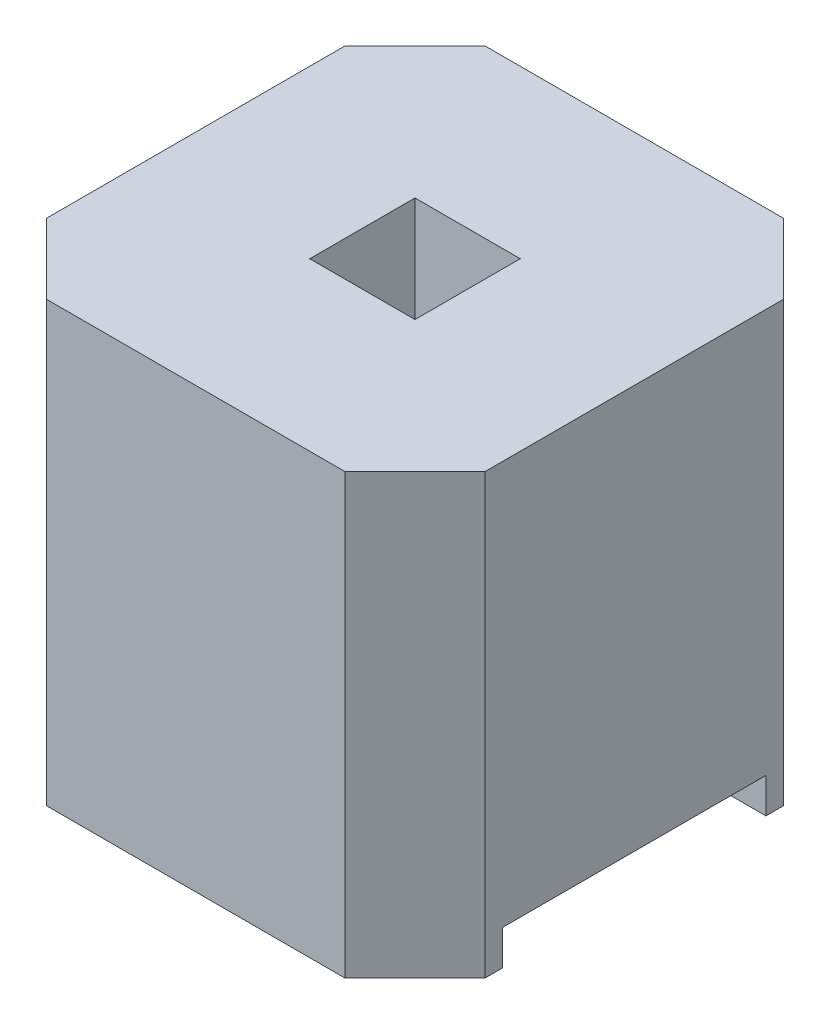
ISO-10303-21;
HEADER;
FILE_DESCRIPTION(('STEP AP214'),'2;1');
FILE_NAME('part.step','',(''),(''),'','','');
FILE_SCHEMA(('AUTOMOTIVE_DESIGN { 1 0 10303 214 1 1 1 1 }'));
ENDSEC;
DATA;
#1=APPLICATION_CONTEXT('core data for automotive mechanical design processes');
#2=APPLICATION_PROTOCOL_DEFINITION('international standard','automotive_design',2000,#1);
#3=PRODUCT_CONTEXT('',#1,'mechanical');
#4=PRODUCT('Part','Part','',(#3));
#5=PRODUCT_RELATED_PRODUCT_CATEGORY('part','',(#4));
#6=PRODUCT_DEFINITION_FORMATION('','',#4);
#7=PRODUCT_DEFINITION_CONTEXT('part definition',#1,'design');
#8=PRODUCT_DEFINITION('design','',#6,#7);
#9=PRODUCT_DEFINITION_SHAPE('','',#8);
#10=(LENGTH_UNIT() NAMED_UNIT(*) SI_UNIT(.MILLI.,.METRE.));
#11=(NAMED_UNIT(*) PLANE_ANGLE_UNIT() SI_UNIT($,.RADIAN.));
#12=(NAMED_UNIT(*) SI_UNIT($,.STERADIAN.) SOLID_ANGLE_UNIT());
#13=UNCERTAINTY_MEASURE_WITH_UNIT(LENGTH_MEASURE(1.E-05),#10,'distance_accuracy_value','');
#14=(GEOMETRIC_REPRESENTATION_CONTEXT(3) GLOBAL_UNCERTAINTY_ASSIGNED_CONTEXT((#13)) GLOBAL_UNIT_ASSIGNED_CONTEXT((#10,
#11,#12)) REPRESENTATION_CONTEXT('',''));
#15=CARTESIAN_POINT('',(0.,0.,0.));
#16=DIRECTION('',(0.,0.,1.));
#17=DIRECTION('',(1.,0.,0.));
#18=AXIS2_PLACEMENT_3D('',#15,#16,#17);
#19=CARTESIAN_POINT('',(0.,0.,0.));
#20=DIRECTION('',(0.,-1.,0.));
#21=DIRECTION('',(0.,0.,-1.));
#22=AXIS2_PLACEMENT_3D('',#19,#20,#21);
#23=PLANE('',#22);
#24=DIRECTION('',(-1.,0.,0.));
#25=VECTOR('',#24,1.);
#26=CARTESIAN_POINT('',(0.,0.,0.75));
#27=LINE('',#26,#25);
#28=CARTESIAN_POINT('',(1.25,0.,0.75));
#29=VERTEX_POINT('',#28);
#30=CARTESIAN_POINT('',(-1.25,0.,0.75));
#31=VERTEX_POINT('',#30);
#32=EDGE_CURVE('E283',#29,#31,#27,.T.);
#33=ORIENTED_EDGE('',*,*,#32,.F.);
#34=DIRECTION('',(0.,0.,-1.));
#35=VECTOR('',#34,1.);
#36=CARTESIAN_POINT('',(1.25,0.,0.850000000000001));
#37=LINE('',#36,#35);
#38=CARTESIAN_POINT('',(1.25,0.,0.850000000000001));
#39=VERTEX_POINT('',#38);
#40=EDGE_CURVE('E165',#39,#29,#37,.T.);
#41=ORIENTED_EDGE('',*,*,#40,.F.);
#42=DIRECTION('',(0.707106781186547,0.,-0.707106781186548));
#43=VECTOR('',#42,1.);
#44=CARTESIAN_POINT('',(0.850000000000001,0.,1.25));
#45=LINE('',#44,#43);
#46=CARTESIAN_POINT('',(0.850000000000001,0.,1.25));
#47=VERTEX_POINT('',#46);
#48=EDGE_CURVE('E176',#47,#39,#45,.T.);
#49=ORIENTED_EDGE('',*,*,#48,.F.);
#50=DIRECTION('',(1.,0.,0.));
#51=VECTOR('',#50,1.);
#52=CARTESIAN_POINT('',(-0.85,0.,1.25));
#53=LINE('',#52,#51);
#54=CARTESIAN_POINT('',(-0.85,0.,1.25));
#55=VERTEX_POINT('',#54);
#56=EDGE_CURVE('E257',#55,#47,#53,.T.);
#57=ORIENTED_EDGE('',*,*,#56,.F.);
#58=DIRECTION('',(0.707106781186547,0.,0.707106781186547));
#59=VECTOR('',#58,1.);
#60=CARTESIAN_POINT('',(-1.25,0.,0.850000000000001));
#61=LINE('',#60,#59);
#62=CARTESIAN_POINT('',(-1.25,0.,0.850000000000001));
#63=VERTEX_POINT('',#62);
#64=EDGE_CURVE('E256',#63,#55,#61,.T.);
#65=ORIENTED_EDGE('',*,*,#64,.F.);
#66=DIRECTION('',(0.,0.,1.));
#67=VECTOR('',#66,1.);
#68=CARTESIAN_POINT('',(-1.25,0.,0.850000000000001));
#69=LINE('',#68,#67);
#70=EDGE_CURVE('E237',#31,#63,#69,.T.);
#71=ORIENTED_EDGE('',*,*,#70,.F.);
#72=EDGE_LOOP('',(#33,#41,#49,#57,#65,#71));
#73=FACE_BOUND('',#72,.T.);
#74=ADVANCED_FACE('F32',(#73),#23,.T.);
#75=CARTESIAN_POINT('',(0.,2.5,0.));
#76=DIRECTION('',(0.,-1.,0.));
#77=DIRECTION('',(0.,0.,-1.));
#78=AXIS2_PLACEMENT_3D('',#75,#76,#77);
#79=PLANE('',#78);
#80=DIRECTION('',(0.,0.,1.));
#81=VECTOR('',#80,1.);
#82=CARTESIAN_POINT('',(-1.25,2.5,0.850000000000001));
#83=LINE('',#82,#81);
#84=CARTESIAN_POINT('',(-1.25,2.5,-0.849999999999999));
#85=VERTEX_POINT('',#84);
#86=CARTESIAN_POINT('',(-1.25,2.5,0.850000000000001));
#87=VERTEX_POINT('',#86);
#88=EDGE_CURVE('E183',#85,#87,#83,.T.);
#89=ORIENTED_EDGE('',*,*,#88,.T.);
#90=DIRECTION('',(0.707106781186547,0.,0.707106781186547));
#91=VECTOR('',#90,1.);
#92=CARTESIAN_POINT('',(-1.25,2.5,0.850000000000001));
#93=LINE('',#92,#91);
#94=CARTESIAN_POINT('',(-0.85,2.5,1.25));
#95=VERTEX_POINT('',#94);
#96=EDGE_CURVE('E240',#87,#95,#93,.T.);
#97=ORIENTED_EDGE('',*,*,#96,.T.);
#98=DIRECTION('',(1.,0.,0.));
#99=VECTOR('',#98,1.);
#100=CARTESIAN_POINT('',(-0.85,2.5,1.25));
#101=LINE('',#100,#99);
#102=CARTESIAN_POINT('',(0.850000000000001,2.5,1.25));
#103=VERTEX_POINT('',#102);
#104=EDGE_CURVE('E242',#95,#103,#101,.T.);
#105=ORIENTED_EDGE('',*,*,#104,.T.);
#106=DIRECTION('',(0.707106781186547,0.,-0.707106781186548));
#107=VECTOR('',#106,1.);
#108=CARTESIAN_POINT('',(0.850000000000001,2.5,1.25));
#109=LINE('',#108,#107);
#110=CARTESIAN_POINT('',(1.25,2.5,0.850000000000001));
#111=VERTEX_POINT('',#110);
#112=EDGE_CURVE('E244',#103,#111,#109,.T.);
#113=ORIENTED_EDGE('',*,*,#112,.T.);
#114=DIRECTION('',(0.,0.,-1.));
#115=VECTOR('',#114,1.);
#116=CARTESIAN_POINT('',(1.25,2.5,0.850000000000001));
#117=LINE('',#116,#115);
#118=CARTESIAN_POINT('',(1.25,2.5,-0.849999999999999));
#119=VERTEX_POINT('',#118);
#120=EDGE_CURVE('E246',#111,#119,#117,.T.);
#121=ORIENTED_EDGE('',*,*,#120,.T.);
#122=DIRECTION('',(-0.707106781186547,0.,-0.707106781186547));
#123=VECTOR('',#122,1.);
#124=CARTESIAN_POINT('',(0.85,2.5,-1.25));
#125=LINE('',#124,#123);
#126=CARTESIAN_POINT('',(0.85,2.5,-1.25));
#127=VERTEX_POINT('',#126);
#128=EDGE_CURVE('E248',#119,#127,#125,.T.);
#129=ORIENTED_EDGE('',*,*,#128,.T.);
#130=DIRECTION('',(-1.,0.,0.));
#131=VECTOR('',#130,1.);
#132=CARTESIAN_POINT('',(-0.85,2.5,-1.25));
#133=LINE('',#132,#131);
#134=CARTESIAN_POINT('',(-0.85,2.5,-1.25));
#135=VERTEX_POINT('',#134);
#136=EDGE_CURVE('E250',#127,#135,#133,.T.);
#137=ORIENTED_EDGE('',*,*,#136,.T.);
#138=DIRECTION('',(-0.707106781186547,0.,0.707106781186547));
#139=VECTOR('',#138,1.);
#140=CARTESIAN_POINT('',(-1.25,2.5,-0.849999999999999));
#141=LINE('',#140,#139);
#142=EDGE_CURVE('E188',#135,#85,#141,.T.);
#143=ORIENTED_EDGE('',*,*,#142,.T.);
#144=EDGE_LOOP('',(#89,#97,#105,#113,#121,#129,#137,#143));
#145=FACE_BOUND('',#144,.T.);
#146=DIRECTION('',(0.,0.,1.));
#147=VECTOR('',#146,1.);
#148=CARTESIAN_POINT('',(-0.3,2.5,-0.299999999999999));
#149=LINE('',#148,#147);
#150=CARTESIAN_POINT('',(-0.3,2.5,-0.299999999999999));
#151=VERTEX_POINT('',#150);
#152=CARTESIAN_POINT('',(-0.3,2.5,0.3));
#153=VERTEX_POINT('',#152);
#154=EDGE_CURVE('E285',#151,#153,#149,.T.);
#155=ORIENTED_EDGE('',*,*,#154,.F.);
#156=DIRECTION('',(-1.,0.,0.));
#157=VECTOR('',#156,1.);
#158=CARTESIAN_POINT('',(0.3,2.5,-0.3));
#159=LINE('',#158,#157);
#160=CARTESIAN_POINT('',(0.3,2.5,-0.3));
#161=VERTEX_POINT('',#160);
#162=EDGE_CURVE('E225',#161,#151,#159,.T.);
#163=ORIENTED_EDGE('',*,*,#162,.F.);
#164=DIRECTION('',(0.,0.,-1.));
#165=VECTOR('',#164,1.);
#166=CARTESIAN_POINT('',(0.3,2.5,-0.3));
#167=LINE('',#166,#165);
#168=CARTESIAN_POINT('',(0.3,2.5,0.3));
#169=VERTEX_POINT('',#168);
#170=EDGE_CURVE('E230',#169,#161,#167,.T.);
#171=ORIENTED_EDGE('',*,*,#170,.F.);
#172=DIRECTION('',(1.,0.,0.));
#173=VECTOR('',#172,1.);
#174=CARTESIAN_POINT('',(0.3,2.5,0.3));
#175=LINE('',#174,#173);
#176=EDGE_CURVE('E287',#153,#169,#175,.T.);
#177=ORIENTED_EDGE('',*,*,#176,.F.);
#178=EDGE_LOOP('',(#155,#163,#171,#177));
#179=FACE_BOUND('',#178,.T.);
#180=ADVANCED_FACE('F295',(#145,#179),#79,.F.);
#181=DIRECTION('',(1.,0.,0.));
#182=VECTOR('',#181,1.);
#183=CARTESIAN_POINT('',(0.,0.,-0.75));
#184=LINE('',#183,#182);
#185=CARTESIAN_POINT('',(-1.25,0.,-0.75));
#186=VERTEX_POINT('',#185);
#187=CARTESIAN_POINT('',(1.25,0.,-0.75));
#188=VERTEX_POINT('',#187);
#189=EDGE_CURVE('E220',#186,#188,#184,.T.);
#190=ORIENTED_EDGE('',*,*,#189,.F.);
#191=CARTESIAN_POINT('',(-1.25,0.,-0.849999999999999));
#192=VERTEX_POINT('',#191);
#193=EDGE_CURVE('E253',#192,#186,#69,.T.);
#194=ORIENTED_EDGE('',*,*,#193,.F.);
#195=DIRECTION('',(-0.707106781186547,0.,0.707106781186547));
#196=VECTOR('',#195,1.);
#197=CARTESIAN_POINT('',(-1.25,0.,-0.849999999999999));
#198=LINE('',#197,#196);
#199=CARTESIAN_POINT('',(-0.85,0.,-1.25));
#200=VERTEX_POINT('',#199);
#201=EDGE_CURVE('E181',#200,#192,#198,.T.);
#202=ORIENTED_EDGE('',*,*,#201,.F.);
#203=DIRECTION('',(-1.,0.,0.));
#204=VECTOR('',#203,1.);
#205=CARTESIAN_POINT('',(-0.85,0.,-1.25));
#206=LINE('',#205,#204);
#207=CARTESIAN_POINT('',(0.85,0.,-1.25));
#208=VERTEX_POINT('',#207);
#209=EDGE_CURVE('E174',#208,#200,#206,.T.);
#210=ORIENTED_EDGE('',*,*,#209,.F.);
#211=DIRECTION('',(-0.707106781186547,0.,-0.707106781186547));
#212=VECTOR('',#211,1.);
#213=CARTESIAN_POINT('',(0.85,0.,-1.25));
#214=LINE('',#213,#212);
#215=CARTESIAN_POINT('',(1.25,0.,-0.849999999999999));
#216=VERTEX_POINT('',#215);
#217=EDGE_CURVE('E171',#216,#208,#214,.T.);
#218=ORIENTED_EDGE('',*,*,#217,.F.);
#219=EDGE_CURVE('E172',#188,#216,#37,.T.);
#220=ORIENTED_EDGE('',*,*,#219,.F.);
#221=EDGE_LOOP('',(#190,#194,#202,#210,#218,#220));
#222=FACE_BOUND('',#221,.T.);
#223=ADVANCED_FACE('F309',(#222),#23,.T.);
#224=CARTESIAN_POINT('',(-1.25,2.5,0.850000000000001));
#225=DIRECTION('',(1.,0.,0.));
#226=DIRECTION('',(0.,0.,-1.));
#227=AXIS2_PLACEMENT_3D('',#224,#225,#226);
#228=PLANE('',#227);
#229=DIRECTION('',(0.,0.,-1.));
#230=VECTOR('',#229,1.);
#231=CARTESIAN_POINT('',(-1.25,0.2,-0.75));
#232=LINE('',#231,#230);
#233=CARTESIAN_POINT('',(-1.25,0.2,0.75));
#234=VERTEX_POINT('',#233);
#235=CARTESIAN_POINT('',(-1.25,0.2,-0.75));
#236=VERTEX_POINT('',#235);
#237=EDGE_CURVE('E273',#234,#236,#232,.T.);
#238=ORIENTED_EDGE('',*,*,#237,.F.);
#239=DIRECTION('',(0.,1.,0.));
#240=VECTOR('',#239,1.);
#241=CARTESIAN_POINT('',(-1.25,-0.2,0.75));
#242=LINE('',#241,#240);
#243=EDGE_CURVE('E149',#31,#234,#242,.T.);
#244=ORIENTED_EDGE('',*,*,#243,.F.);
#245=ORIENTED_EDGE('',*,*,#70,.T.);
#246=DIRECTION('',(0.,-1.,0.));
#247=VECTOR('',#246,1.);
#248=CARTESIAN_POINT('',(-1.25,2.5,0.850000000000001));
#249=LINE('',#248,#247);
#250=EDGE_CURVE('E204',#87,#63,#249,.T.);
#251=ORIENTED_EDGE('',*,*,#250,.F.);
#252=ORIENTED_EDGE('',*,*,#88,.F.);
#253=DIRECTION('',(0.,-1.,0.));
#254=VECTOR('',#253,1.);
#255=CARTESIAN_POINT('',(-1.25,2.5,-0.849999999999999));
#256=LINE('',#255,#254);
#257=EDGE_CURVE('E184',#85,#192,#256,.T.);
#258=ORIENTED_EDGE('',*,*,#257,.T.);
#259=ORIENTED_EDGE('',*,*,#193,.T.);
#260=DIRECTION('',(0.,-1.,0.));
#261=VECTOR('',#260,1.);
#262=CARTESIAN_POINT('',(-1.25,-0.2,-0.75));
#263=LINE('',#262,#261);
#264=EDGE_CURVE('E159',#236,#186,#263,.T.);
#265=ORIENTED_EDGE('',*,*,#264,.F.);
#266=EDGE_LOOP('',(#238,#244,#245,#251,#252,#258,#259,#265));
#267=FACE_BOUND('',#266,.T.);
#268=ADVANCED_FACE('F34',(#267),#228,.F.);
#269=CARTESIAN_POINT('',(-1.25,2.5,0.850000000000001));
#270=DIRECTION('',(0.707106781186548,0.,-0.707106781186548));
#271=DIRECTION('',(-0.707106781186548,0.,-0.707106781186548));
#272=AXIS2_PLACEMENT_3D('',#269,#270,#271);
#273=PLANE('',#272);
#274=ORIENTED_EDGE('',*,*,#64,.T.);
#275=DIRECTION('',(0.,-1.,0.));
#276=VECTOR('',#275,1.);
#277=CARTESIAN_POINT('',(-0.85,2.5,1.25));
#278=LINE('',#277,#276);
#279=EDGE_CURVE('E201',#95,#55,#278,.T.);
#280=ORIENTED_EDGE('',*,*,#279,.F.);
#281=ORIENTED_EDGE('',*,*,#96,.F.);
#282=ORIENTED_EDGE('',*,*,#250,.T.);
#283=EDGE_LOOP('',(#274,#280,#281,#282));
#284=FACE_BOUND('',#283,.T.);
#285=ADVANCED_FACE('F269',(#284),#273,.F.);
#286=CARTESIAN_POINT('',(-0.85,2.5,1.25));
#287=DIRECTION('',(0.,0.,-1.));
#288=DIRECTION('',(-1.,0.,0.));
#289=AXIS2_PLACEMENT_3D('',#286,#287,#288);
#290=PLANE('',#289);
#291=ORIENTED_EDGE('',*,*,#56,.T.);
#292=DIRECTION('',(0.,-1.,0.));
#293=VECTOR('',#292,1.);
#294=CARTESIAN_POINT('',(0.850000000000001,2.5,1.25));
#295=LINE('',#294,#293);
#296=EDGE_CURVE('E198',#103,#47,#295,.T.);
#297=ORIENTED_EDGE('',*,*,#296,.F.);
#298=ORIENTED_EDGE('',*,*,#104,.F.);
#299=ORIENTED_EDGE('',*,*,#279,.T.);
#300=EDGE_LOOP('',(#291,#297,#298,#299));
#301=FACE_BOUND('',#300,.T.);
#302=ADVANCED_FACE('F340',(#301),#290,.F.);
#303=CARTESIAN_POINT('',(0.850000000000001,2.5,1.25));
#304=DIRECTION('',(-0.707106781186548,0.,-0.707106781186547));
#305=DIRECTION('',(-0.707106781186547,0.,0.707106781186548));
#306=AXIS2_PLACEMENT_3D('',#303,#304,#305);
#307=PLANE('',#306);
#308=ORIENTED_EDGE('',*,*,#48,.T.);
#309=DIRECTION('',(0.,-1.,0.));
#310=VECTOR('',#309,1.);
#311=CARTESIAN_POINT('',(1.25,2.5,0.850000000000001));
#312=LINE('',#311,#310);
#313=EDGE_CURVE('E168',#111,#39,#312,.T.);
#314=ORIENTED_EDGE('',*,*,#313,.F.);
#315=ORIENTED_EDGE('',*,*,#112,.F.);
#316=ORIENTED_EDGE('',*,*,#296,.T.);
#317=EDGE_LOOP('',(#308,#314,#315,#316));
#318=FACE_BOUND('',#317,.T.);
#319=ADVANCED_FACE('F262',(#318),#307,.F.);
#320=CARTESIAN_POINT('',(1.25,2.5,0.850000000000001));
#321=DIRECTION('',(-1.,0.,0.));
#322=DIRECTION('',(0.,0.,1.));
#323=AXIS2_PLACEMENT_3D('',#320,#321,#322);
#324=PLANE('',#323);
#325=ORIENTED_EDGE('',*,*,#40,.T.);
#326=DIRECTION('',(0.,1.,0.));
#327=VECTOR('',#326,1.);
#328=CARTESIAN_POINT('',(1.25,2.5,0.75));
#329=LINE('',#328,#327);
#330=CARTESIAN_POINT('',(1.25,0.2,0.75));
#331=VERTEX_POINT('',#330);
#332=EDGE_CURVE('E11',#29,#331,#329,.T.);
#333=ORIENTED_EDGE('',*,*,#332,.T.);
#334=DIRECTION('',(0.,0.,-1.));
#335=VECTOR('',#334,1.);
#336=CARTESIAN_POINT('',(1.25,0.2,-0.75));
#337=LINE('',#336,#335);
#338=CARTESIAN_POINT('',(1.25,0.2,-0.75));
#339=VERTEX_POINT('',#338);
#340=EDGE_CURVE('E156',#331,#339,#337,.T.);
#341=ORIENTED_EDGE('',*,*,#340,.T.);
#342=DIRECTION('',(0.,-1.,0.));
#343=VECTOR('',#342,1.);
#344=CARTESIAN_POINT('',(1.25,-0.2,-0.75));
#345=LINE('',#344,#343);
#346=EDGE_CURVE('E47',#339,#188,#345,.T.);
#347=ORIENTED_EDGE('',*,*,#346,.T.);
#348=ORIENTED_EDGE('',*,*,#219,.T.);
#349=DIRECTION('',(0.,-1.,0.));
#350=VECTOR('',#349,1.);
#351=CARTESIAN_POINT('',(1.25,2.5,-0.849999999999999));
#352=LINE('',#351,#350);
#353=EDGE_CURVE('E194',#119,#216,#352,.T.);
#354=ORIENTED_EDGE('',*,*,#353,.F.);
#355=ORIENTED_EDGE('',*,*,#120,.F.);
#356=ORIENTED_EDGE('',*,*,#313,.T.);
#357=EDGE_LOOP('',(#325,#333,#341,#347,#348,#354,#355,#356));
#358=FACE_BOUND('',#357,.T.);
#359=ADVANCED_FACE('F162',(#358),#324,.F.);
#360=CARTESIAN_POINT('',(0.85,2.5,-1.25));
#361=DIRECTION('',(-0.707106781186548,0.,0.707106781186548));
#362=DIRECTION('',(0.707106781186548,0.,0.707106781186548));
#363=AXIS2_PLACEMENT_3D('',#360,#361,#362);
#364=PLANE('',#363);
#365=ORIENTED_EDGE('',*,*,#217,.T.);
#366=DIRECTION('',(0.,-1.,0.));
#367=VECTOR('',#366,1.);
#368=CARTESIAN_POINT('',(0.85,2.5,-1.25));
#369=LINE('',#368,#367);
#370=EDGE_CURVE('E191',#127,#208,#369,.T.);
#371=ORIENTED_EDGE('',*,*,#370,.F.);
#372=ORIENTED_EDGE('',*,*,#128,.F.);
#373=ORIENTED_EDGE('',*,*,#353,.T.);
#374=EDGE_LOOP('',(#365,#371,#372,#373));
#375=FACE_BOUND('',#374,.T.);
#376=ADVANCED_FACE('F337',(#375),#364,.F.);
#377=CARTESIAN_POINT('',(-0.85,2.5,-1.25));
#378=DIRECTION('',(0.,0.,1.));
#379=DIRECTION('',(1.,0.,0.));
#380=AXIS2_PLACEMENT_3D('',#377,#378,#379);
#381=PLANE('',#380);
#382=ORIENTED_EDGE('',*,*,#209,.T.);
#383=DIRECTION('',(0.,-1.,0.));
#384=VECTOR('',#383,1.);
#385=CARTESIAN_POINT('',(-0.85,2.5,-1.25));
#386=LINE('',#385,#384);
#387=EDGE_CURVE('E187',#135,#200,#386,.T.);
#388=ORIENTED_EDGE('',*,*,#387,.F.);
#389=ORIENTED_EDGE('',*,*,#136,.F.);
#390=ORIENTED_EDGE('',*,*,#370,.T.);
#391=EDGE_LOOP('',(#382,#388,#389,#390));
#392=FACE_BOUND('',#391,.T.);
#393=ADVANCED_FACE('F332',(#392),#381,.F.);
#394=CARTESIAN_POINT('',(-1.25,2.5,-0.849999999999999));
#395=DIRECTION('',(0.707106781186548,0.,0.707106781186548));
#396=DIRECTION('',(0.707106781186548,0.,-0.707106781186548));
#397=AXIS2_PLACEMENT_3D('',#394,#395,#396);
#398=PLANE('',#397);
#399=ORIENTED_EDGE('',*,*,#201,.T.);
#400=ORIENTED_EDGE('',*,*,#257,.F.);
#401=ORIENTED_EDGE('',*,*,#142,.F.);
#402=ORIENTED_EDGE('',*,*,#387,.T.);
#403=EDGE_LOOP('',(#399,#400,#401,#402));
#404=FACE_BOUND('',#403,.T.);
#405=ADVANCED_FACE('F305',(#404),#398,.F.);
#406=CARTESIAN_POINT('',(-0.3,2.5,-0.299999999999999));
#407=DIRECTION('',(1.,0.,0.));
#408=DIRECTION('',(0.,0.,-1.));
#409=AXIS2_PLACEMENT_3D('',#406,#407,#408);
#410=PLANE('',#409);
#411=DIRECTION('',(0.,0.,1.));
#412=VECTOR('',#411,1.);
#413=CARTESIAN_POINT('',(-0.3,0.2,-0.299999999999999));
#414=LINE('',#413,#412);
#415=CARTESIAN_POINT('',(-0.3,0.2,-0.299999999999999));
#416=VERTEX_POINT('',#415);
#417=CARTESIAN_POINT('',(-0.3,0.2,0.3));
#418=VERTEX_POINT('',#417);
#419=EDGE_CURVE('E207',#416,#418,#414,.T.);
#420=ORIENTED_EDGE('',*,*,#419,.F.);
#421=DIRECTION('',(0.,-1.,0.));
#422=VECTOR('',#421,1.);
#423=CARTESIAN_POINT('',(-0.3,2.5,-0.299999999999999));
#424=LINE('',#423,#422);
#425=EDGE_CURVE('E216',#151,#416,#424,.T.);
#426=ORIENTED_EDGE('',*,*,#425,.F.);
#427=ORIENTED_EDGE('',*,*,#154,.T.);
#428=DIRECTION('',(0.,-1.,0.));
#429=VECTOR('',#428,1.);
#430=CARTESIAN_POINT('',(-0.3,2.5,0.3));
#431=LINE('',#430,#429);
#432=EDGE_CURVE('E219',#153,#418,#431,.T.);
#433=ORIENTED_EDGE('',*,*,#432,.T.);
#434=EDGE_LOOP('',(#420,#426,#427,#433));
#435=FACE_BOUND('',#434,.T.);
#436=ADVANCED_FACE('F215',(#435),#410,.T.);
#437=CARTESIAN_POINT('',(0.3,2.5,0.3));
#438=DIRECTION('',(0.,0.,-1.));
#439=DIRECTION('',(-1.,0.,0.));
#440=AXIS2_PLACEMENT_3D('',#437,#438,#439);
#441=PLANE('',#440);
#442=DIRECTION('',(1.,0.,0.));
#443=VECTOR('',#442,1.);
#444=CARTESIAN_POINT('',(0.3,0.2,0.3));
#445=LINE('',#444,#443);
#446=CARTESIAN_POINT('',(0.3,0.2,0.3));
#447=VERTEX_POINT('',#446);
#448=EDGE_CURVE('E221',#418,#447,#445,.T.);
#449=ORIENTED_EDGE('',*,*,#448,.F.);
#450=ORIENTED_EDGE('',*,*,#432,.F.);
#451=ORIENTED_EDGE('',*,*,#176,.T.);
#452=DIRECTION('',(0.,-1.,0.));
#453=VECTOR('',#452,1.);
#454=CARTESIAN_POINT('',(0.3,2.5,0.3));
#455=LINE('',#454,#453);
#456=EDGE_CURVE('E228',#169,#447,#455,.T.);
#457=ORIENTED_EDGE('',*,*,#456,.T.);
#458=EDGE_LOOP('',(#449,#450,#451,#457));
#459=FACE_BOUND('',#458,.T.);
#460=ADVANCED_FACE('F297',(#459),#441,.T.);
#461=CARTESIAN_POINT('',(0.3,2.5,-0.3));
#462=DIRECTION('',(-1.,0.,0.));
#463=DIRECTION('',(0.,0.,1.));
#464=AXIS2_PLACEMENT_3D('',#461,#462,#463);
#465=PLANE('',#464);
#466=DIRECTION('',(0.,0.,-1.));
#467=VECTOR('',#466,1.);
#468=CARTESIAN_POINT('',(0.3,0.2,-0.3));
#469=LINE('',#468,#467);
#470=CARTESIAN_POINT('',(0.3,0.2,-0.3));
#471=VERTEX_POINT('',#470);
#472=EDGE_CURVE('E55',#447,#471,#469,.T.);
#473=ORIENTED_EDGE('',*,*,#472,.F.);
#474=ORIENTED_EDGE('',*,*,#456,.F.);
#475=ORIENTED_EDGE('',*,*,#170,.T.);
#476=DIRECTION('',(0.,-1.,0.));
#477=VECTOR('',#476,1.);
#478=CARTESIAN_POINT('',(0.3,2.5,-0.3));
#479=LINE('',#478,#477);
#480=EDGE_CURVE('E226',#161,#471,#479,.T.);
#481=ORIENTED_EDGE('',*,*,#480,.T.);
#482=EDGE_LOOP('',(#473,#474,#475,#481));
#483=FACE_BOUND('',#482,.T.);
#484=ADVANCED_FACE('F292',(#483),#465,.T.);
#485=CARTESIAN_POINT('',(0.3,2.5,-0.3));
#486=DIRECTION('',(0.,0.,1.));
#487=DIRECTION('',(1.,0.,0.));
#488=AXIS2_PLACEMENT_3D('',#485,#486,#487);
#489=PLANE('',#488);
#490=DIRECTION('',(-1.,0.,0.));
#491=VECTOR('',#490,1.);
#492=CARTESIAN_POINT('',(0.3,0.2,-0.3));
#493=LINE('',#492,#491);
#494=EDGE_CURVE('E40',#471,#416,#493,.T.);
#495=ORIENTED_EDGE('',*,*,#494,.F.);
#496=ORIENTED_EDGE('',*,*,#480,.F.);
#497=ORIENTED_EDGE('',*,*,#162,.T.);
#498=ORIENTED_EDGE('',*,*,#425,.T.);
#499=EDGE_LOOP('',(#495,#496,#497,#498));
#500=FACE_BOUND('',#499,.T.);
#501=ADVANCED_FACE('F223',(#500),#489,.T.);
#502=CARTESIAN_POINT('',(1.25,-0.2,0.75));
#503=DIRECTION('',(0.,0.,1.));
#504=DIRECTION('',(1.,0.,0.));
#505=AXIS2_PLACEMENT_3D('',#502,#503,#504);
#506=PLANE('',#505);
#507=ORIENTED_EDGE('',*,*,#32,.T.);
#508=ORIENTED_EDGE('',*,*,#243,.T.);
#509=DIRECTION('',(-1.,0.,0.));
#510=VECTOR('',#509,1.);
#511=CARTESIAN_POINT('',(1.25,0.2,0.75));
#512=LINE('',#511,#510);
#513=EDGE_CURVE('E144',#331,#234,#512,.T.);
#514=ORIENTED_EDGE('',*,*,#513,.F.);
#515=ORIENTED_EDGE('',*,*,#332,.F.);
#516=EDGE_LOOP('',(#507,#508,#514,#515));
#517=FACE_BOUND('',#516,.T.);
#518=ADVANCED_FACE('F146',(#517),#506,.F.);
#519=CARTESIAN_POINT('',(1.25,-0.2,-0.75));
#520=DIRECTION('',(0.,0.,-1.));
#521=DIRECTION('',(-1.,0.,0.));
#522=AXIS2_PLACEMENT_3D('',#519,#520,#521);
#523=PLANE('',#522);
#524=ORIENTED_EDGE('',*,*,#189,.T.);
#525=ORIENTED_EDGE('',*,*,#346,.F.);
#526=DIRECTION('',(-1.,0.,0.));
#527=VECTOR('',#526,1.);
#528=CARTESIAN_POINT('',(1.25,0.2,-0.75));
#529=LINE('',#528,#527);
#530=EDGE_CURVE('E153',#339,#236,#529,.T.);
#531=ORIENTED_EDGE('',*,*,#530,.T.);
#532=ORIENTED_EDGE('',*,*,#264,.T.);
#533=EDGE_LOOP('',(#524,#525,#531,#532));
#534=FACE_BOUND('',#533,.T.);
#535=ADVANCED_FACE('F395',(#534),#523,.F.);
#536=CARTESIAN_POINT('',(1.25,0.2,-0.75));
#537=DIRECTION('',(0.,1.,0.));
#538=DIRECTION('',(0.,0.,1.));
#539=AXIS2_PLACEMENT_3D('',#536,#537,#538);
#540=PLANE('',#539);
#541=ORIENTED_EDGE('',*,*,#419,.T.);
#542=ORIENTED_EDGE('',*,*,#448,.T.);
#543=ORIENTED_EDGE('',*,*,#472,.T.);
#544=ORIENTED_EDGE('',*,*,#494,.T.);
#545=EDGE_LOOP('',(#541,#542,#543,#544));
#546=FACE_BOUND('',#545,.T.);
#547=ORIENTED_EDGE('',*,*,#237,.T.);
#548=ORIENTED_EDGE('',*,*,#530,.F.);
#549=ORIENTED_EDGE('',*,*,#340,.F.);
#550=ORIENTED_EDGE('',*,*,#513,.T.);
#551=EDGE_LOOP('',(#547,#548,#549,#550));
#552=FACE_BOUND('',#551,.T.);
#553=ADVANCED_FACE('F157',(#546,#552),#540,.F.);
#554=CLOSED_SHELL('',(#74,#180,#223,#268,#285,#302,#319,#359,#376,#393,#405,#436,#460,#484,#501,
#518,#535,#553));
#555=MANIFOLD_SOLID_BREP('B2',#554);
#556=ADVANCED_BREP_SHAPE_REPRESENTATION('',(#18,#555),#14);
#557=SHAPE_DEFINITION_REPRESENTATION(#9,#556);
ENDSEC;
END-ISO-10303-21;
